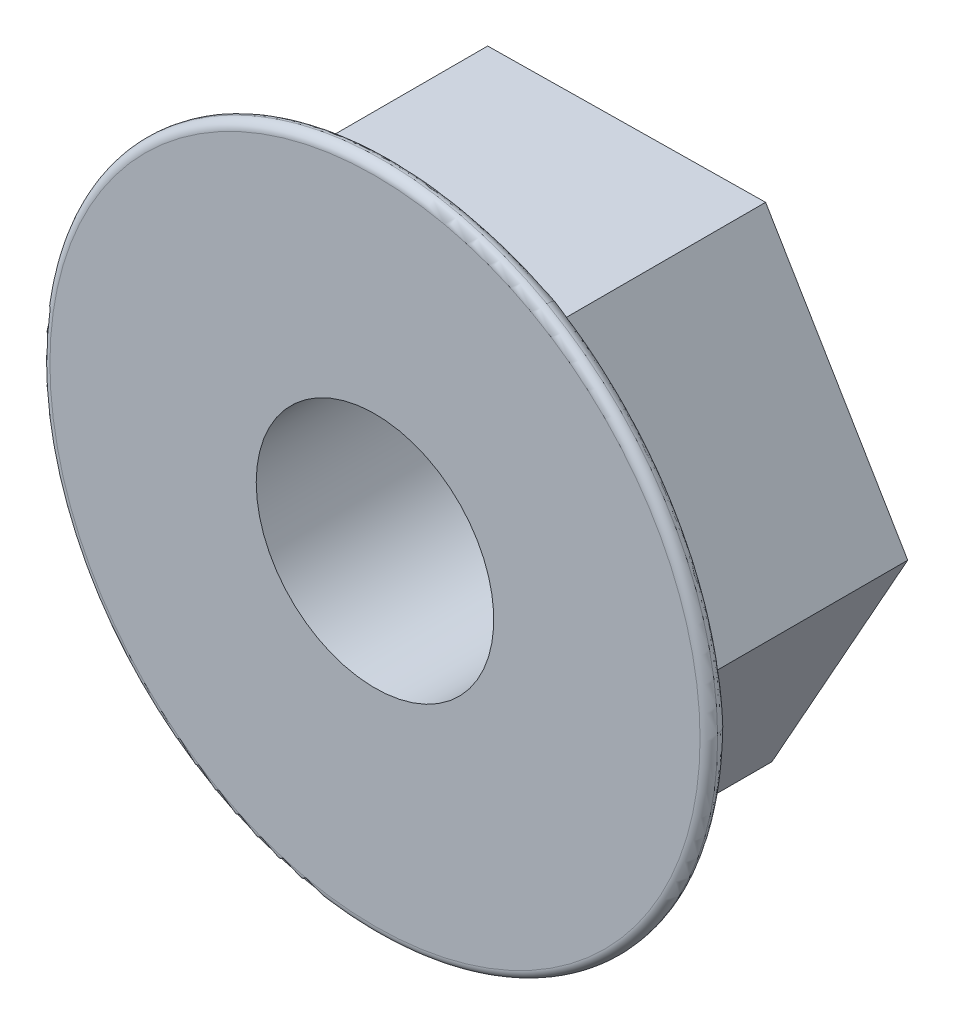
ISO-10303-21;
HEADER;
FILE_DESCRIPTION(('STEP AP214'),'2;1');
FILE_NAME('part.step','',(''),(''),'','','');
FILE_SCHEMA(('AUTOMOTIVE_DESIGN { 1 0 10303 214 1 1 1 1 }'));
ENDSEC;
DATA;
#1=APPLICATION_CONTEXT('core data for automotive mechanical design processes');
#2=APPLICATION_PROTOCOL_DEFINITION('international standard','automotive_design',2000,#1);
#3=PRODUCT_CONTEXT('',#1,'mechanical');
#4=PRODUCT('Part','Part','',(#3));
#5=PRODUCT_RELATED_PRODUCT_CATEGORY('part','',(#4));
#6=PRODUCT_DEFINITION_FORMATION('','',#4);
#7=PRODUCT_DEFINITION_CONTEXT('part definition',#1,'design');
#8=PRODUCT_DEFINITION('design','',#6,#7);
#9=PRODUCT_DEFINITION_SHAPE('','',#8);
#10=(LENGTH_UNIT() NAMED_UNIT(*) SI_UNIT(.MILLI.,.METRE.));
#11=(NAMED_UNIT(*) PLANE_ANGLE_UNIT() SI_UNIT($,.RADIAN.));
#12=(NAMED_UNIT(*) SI_UNIT($,.STERADIAN.) SOLID_ANGLE_UNIT());
#13=UNCERTAINTY_MEASURE_WITH_UNIT(LENGTH_MEASURE(1.E-05),#10,'distance_accuracy_value','');
#14=(GEOMETRIC_REPRESENTATION_CONTEXT(3) GLOBAL_UNCERTAINTY_ASSIGNED_CONTEXT((#13)) GLOBAL_UNIT_ASSIGNED_CONTEXT((#10,
#11,#12)) REPRESENTATION_CONTEXT('',''));
#15=CARTESIAN_POINT('',(0.,0.,0.));
#16=DIRECTION('',(0.,0.,1.));
#17=DIRECTION('',(1.,0.,0.));
#18=AXIS2_PLACEMENT_3D('',#15,#16,#17);
#19=CARTESIAN_POINT('',(0.,0.,0.));
#20=DIRECTION('',(0.,0.,1.));
#21=DIRECTION('',(1.,0.,0.));
#22=AXIS2_PLACEMENT_3D('',#19,#20,#21);
#23=PLANE('',#22);
#24=DIRECTION('',(0.999915696242774,0.0129846219555318,0.));
#25=VECTOR('',#24,1.);
#26=CARTESIAN_POINT('',(-1.93278563744729,-3.45038737144263,0.));
#27=LINE('',#26,#25);
#28=CARTESIAN_POINT('',(-1.93278563744729,-3.45038737144263,0.));
#29=VERTEX_POINT('',#28);
#30=CARTESIAN_POINT('',(2.02173029784268,-3.39903514782037,0.));
#31=VERTEX_POINT('',#30);
#32=EDGE_CURVE('E723',#29,#31,#27,.T.);
#33=ORIENTED_EDGE('',*,*,#32,.F.);
#34=DIRECTION('',(0.511202860593414,-0.859460083611281,0.));
#35=VECTOR('',#34,1.);
#36=CARTESIAN_POINT('',(-3.95451593528998,-0.0513522236222572,0.));
#37=LINE('',#36,#35);
#38=CARTESIAN_POINT('',(-3.95451593528998,-0.0513522236222572,0.));
#39=VERTEX_POINT('',#38);
#40=EDGE_CURVE('E240',#39,#29,#37,.T.);
#41=ORIENTED_EDGE('',*,*,#40,.F.);
#42=DIRECTION('',(-0.48871283564936,-0.872444705566812,0.));
#43=VECTOR('',#42,1.);
#44=CARTESIAN_POINT('',(-2.02173029784268,3.39903514782037,0.));
#45=LINE('',#44,#43);
#46=CARTESIAN_POINT('',(-2.02173029784268,3.39903514782037,0.));
#47=VERTEX_POINT('',#46);
#48=EDGE_CURVE('E712',#47,#39,#45,.T.);
#49=ORIENTED_EDGE('',*,*,#48,.F.);
#50=DIRECTION('',(-0.999915696242774,-0.0129846219555313,0.));
#51=VECTOR('',#50,1.);
#52=CARTESIAN_POINT('',(1.93278563744729,3.45038737144263,0.));
#53=LINE('',#52,#51);
#54=CARTESIAN_POINT('',(1.93278563744729,3.45038737144263,0.));
#55=VERTEX_POINT('',#54);
#56=EDGE_CURVE('E715',#55,#47,#53,.T.);
#57=ORIENTED_EDGE('',*,*,#56,.F.);
#58=DIRECTION('',(-0.511202860593415,0.859460083611281,0.));
#59=VECTOR('',#58,1.);
#60=CARTESIAN_POINT('',(3.95451593528998,0.0513522236222591,0.));
#61=LINE('',#60,#59);
#62=CARTESIAN_POINT('',(3.95451593528998,0.0513522236222591,0.));
#63=VERTEX_POINT('',#62);
#64=EDGE_CURVE('E718',#63,#55,#61,.T.);
#65=ORIENTED_EDGE('',*,*,#64,.F.);
#66=DIRECTION('',(0.48871283564936,0.872444705566812,0.));
#67=VECTOR('',#66,1.);
#68=CARTESIAN_POINT('',(2.02173029784268,-3.39903514782037,0.));
#69=LINE('',#68,#67);
#70=EDGE_CURVE('E721',#31,#63,#69,.T.);
#71=ORIENTED_EDGE('',*,*,#70,.F.);
#72=EDGE_LOOP('',(#33,#41,#49,#57,#65,#71));
#73=FACE_BOUND('',#72,.T.);
#74=CARTESIAN_POINT('',(0.,0.,0.));
#75=DIRECTION('',(0.,0.,1.));
#76=DIRECTION('',(1.,0.,0.));
#77=AXIS2_PLACEMENT_3D('',#74,#75,#76);
#78=CIRCLE('',#77,1.69);
#79=CARTESIAN_POINT('',(1.69,0.,0.));
#80=VERTEX_POINT('',#79);
#81=EDGE_CURVE('E344',#80,#80,#78,.T.);
#82=ORIENTED_EDGE('',*,*,#81,.T.);
#83=EDGE_LOOP('',(#82));
#84=FACE_BOUND('',#83,.T.);
#85=ADVANCED_FACE('F147',(#73,#84),#23,.F.);
#86=CARTESIAN_POINT('',(-1.93278563744729,-3.45038737144263,3.));
#87=DIRECTION('',(-0.0129846219555318,0.999915696242774,0.));
#88=DIRECTION('',(-0.999915696242774,-0.0129846219555318,0.));
#89=AXIS2_PLACEMENT_3D('',#86,#87,#88);
#90=PLANE('',#89);
#91=ORIENTED_EDGE('',*,*,#32,.T.);
#92=DIRECTION('',(0.,0.,-1.));
#93=VECTOR('',#92,1.);
#94=CARTESIAN_POINT('',(2.02173029784268,-3.39903514782037,3.));
#95=LINE('',#94,#93);
#96=CARTESIAN_POINT('',(2.02173029784268,-3.39903514782037,3.));
#97=VERTEX_POINT('',#96);
#98=EDGE_CURVE('E160',#97,#31,#95,.T.);
#99=ORIENTED_EDGE('',*,*,#98,.F.);
#100=DIRECTION('',(-0.999915696242774,-0.0129846219555318,0.));
#101=VECTOR('',#100,1.);
#102=CARTESIAN_POINT('',(-1.93278563744729,-3.45038737144263,3.));
#103=LINE('',#102,#101);
#104=CARTESIAN_POINT('',(-1.93278563744729,-3.45038737144263,3.));
#105=VERTEX_POINT('',#104);
#106=EDGE_CURVE('E227',#105,#97,#103,.F.);
#107=ORIENTED_EDGE('',*,*,#106,.F.);
#108=DIRECTION('',(0.,0.,-1.));
#109=VECTOR('',#108,1.);
#110=CARTESIAN_POINT('',(-1.93278563744729,-3.45038737144263,3.));
#111=LINE('',#110,#109);
#112=EDGE_CURVE('E231',#105,#29,#111,.T.);
#113=ORIENTED_EDGE('',*,*,#112,.T.);
#114=EDGE_LOOP('',(#91,#99,#107,#113));
#115=FACE_BOUND('',#114,.T.);
#116=ADVANCED_FACE('F230',(#115),#90,.F.);
#117=CARTESIAN_POINT('',(2.02173029784268,-3.39903514782037,3.));
#118=DIRECTION('',(-0.872444705566812,0.48871283564936,0.));
#119=DIRECTION('',(-0.48871283564936,-0.872444705566812,0.));
#120=AXIS2_PLACEMENT_3D('',#117,#118,#119);
#121=PLANE('',#120);
#122=ORIENTED_EDGE('',*,*,#70,.T.);
#123=DIRECTION('',(0.,0.,-1.));
#124=VECTOR('',#123,1.);
#125=CARTESIAN_POINT('',(3.95451593528998,0.0513522236222591,3.));
#126=LINE('',#125,#124);
#127=CARTESIAN_POINT('',(3.95451593528998,0.0513522236222596,3.));
#128=VERTEX_POINT('',#127);
#129=EDGE_CURVE('E696',#128,#63,#126,.T.);
#130=ORIENTED_EDGE('',*,*,#129,.F.);
#131=DIRECTION('',(-0.48871283564936,-0.872444705566812,0.));
#132=VECTOR('',#131,1.);
#133=CARTESIAN_POINT('',(2.02173029784268,-3.39903514782037,3.));
#134=LINE('',#133,#132);
#135=EDGE_CURVE('E239',#97,#128,#134,.F.);
#136=ORIENTED_EDGE('',*,*,#135,.F.);
#137=ORIENTED_EDGE('',*,*,#98,.T.);
#138=EDGE_LOOP('',(#122,#130,#136,#137));
#139=FACE_BOUND('',#138,.T.);
#140=ADVANCED_FACE('F470',(#139),#121,.F.);
#141=CARTESIAN_POINT('',(3.95451593528998,0.0513522236222591,3.));
#142=DIRECTION('',(-0.859460083611281,-0.511202860593415,0.));
#143=DIRECTION('',(0.511202860593415,-0.859460083611281,0.));
#144=AXIS2_PLACEMENT_3D('',#141,#142,#143);
#145=PLANE('',#144);
#146=ORIENTED_EDGE('',*,*,#64,.T.);
#147=DIRECTION('',(0.,0.,-1.));
#148=VECTOR('',#147,1.);
#149=CARTESIAN_POINT('',(1.93278563744729,3.45038737144263,3.));
#150=LINE('',#149,#148);
#151=CARTESIAN_POINT('',(1.93278563744729,3.45038737144263,3.));
#152=VERTEX_POINT('',#151);
#153=EDGE_CURVE('E700',#152,#55,#150,.T.);
#154=ORIENTED_EDGE('',*,*,#153,.F.);
#155=DIRECTION('',(0.511202860593415,-0.859460083611281,0.));
#156=VECTOR('',#155,1.);
#157=CARTESIAN_POINT('',(3.95451593528998,0.0513522236222591,3.));
#158=LINE('',#157,#156);
#159=EDGE_CURVE('E687',#128,#152,#158,.F.);
#160=ORIENTED_EDGE('',*,*,#159,.F.);
#161=ORIENTED_EDGE('',*,*,#129,.T.);
#162=EDGE_LOOP('',(#146,#154,#160,#161));
#163=FACE_BOUND('',#162,.T.);
#164=ADVANCED_FACE('F466',(#163),#145,.F.);
#165=CARTESIAN_POINT('',(1.93278563744729,3.45038737144263,3.));
#166=DIRECTION('',(0.0129846219555313,-0.999915696242774,0.));
#167=DIRECTION('',(0.999915696242774,0.0129846219555313,0.));
#168=AXIS2_PLACEMENT_3D('',#165,#166,#167);
#169=PLANE('',#168);
#170=ORIENTED_EDGE('',*,*,#56,.T.);
#171=DIRECTION('',(0.,0.,-1.));
#172=VECTOR('',#171,1.);
#173=CARTESIAN_POINT('',(-2.02173029784268,3.39903514782037,3.));
#174=LINE('',#173,#172);
#175=CARTESIAN_POINT('',(-2.02173029784268,3.39903514782037,3.));
#176=VERTEX_POINT('',#175);
#177=EDGE_CURVE('E704',#176,#47,#174,.T.);
#178=ORIENTED_EDGE('',*,*,#177,.F.);
#179=DIRECTION('',(0.999915696242774,0.0129846219555313,0.));
#180=VECTOR('',#179,1.);
#181=CARTESIAN_POINT('',(1.93278563744729,3.45038737144263,3.));
#182=LINE('',#181,#180);
#183=EDGE_CURVE('E268',#152,#176,#182,.F.);
#184=ORIENTED_EDGE('',*,*,#183,.F.);
#185=ORIENTED_EDGE('',*,*,#153,.T.);
#186=EDGE_LOOP('',(#170,#178,#184,#185));
#187=FACE_BOUND('',#186,.T.);
#188=ADVANCED_FACE('F463',(#187),#169,.F.);
#189=CARTESIAN_POINT('',(-2.02173029784268,3.39903514782037,3.));
#190=DIRECTION('',(0.872444705566812,-0.48871283564936,0.));
#191=DIRECTION('',(0.48871283564936,0.872444705566812,0.));
#192=AXIS2_PLACEMENT_3D('',#189,#190,#191);
#193=PLANE('',#192);
#194=ORIENTED_EDGE('',*,*,#48,.T.);
#195=DIRECTION('',(0.,0.,-1.));
#196=VECTOR('',#195,1.);
#197=CARTESIAN_POINT('',(-3.95451593528998,-0.0513522236222572,3.));
#198=LINE('',#197,#196);
#199=CARTESIAN_POINT('',(-3.95451593528998,-0.0513522236222578,3.));
#200=VERTEX_POINT('',#199);
#201=EDGE_CURVE('E168',#200,#39,#198,.T.);
#202=ORIENTED_EDGE('',*,*,#201,.F.);
#203=DIRECTION('',(0.48871283564936,0.872444705566812,0.));
#204=VECTOR('',#203,1.);
#205=CARTESIAN_POINT('',(-2.02173029784268,3.39903514782037,3.));
#206=LINE('',#205,#204);
#207=EDGE_CURVE('E265',#176,#200,#206,.F.);
#208=ORIENTED_EDGE('',*,*,#207,.F.);
#209=ORIENTED_EDGE('',*,*,#177,.T.);
#210=EDGE_LOOP('',(#194,#202,#208,#209));
#211=FACE_BOUND('',#210,.T.);
#212=ADVANCED_FACE('F460',(#211),#193,.F.);
#213=CARTESIAN_POINT('',(-3.95451593528998,-0.0513522236222572,3.));
#214=DIRECTION('',(0.859460083611281,0.511202860593414,0.));
#215=DIRECTION('',(-0.511202860593414,0.859460083611281,0.));
#216=AXIS2_PLACEMENT_3D('',#213,#214,#215);
#217=PLANE('',#216);
#218=ORIENTED_EDGE('',*,*,#40,.T.);
#219=ORIENTED_EDGE('',*,*,#112,.F.);
#220=DIRECTION('',(-0.511202860593414,0.859460083611281,0.));
#221=VECTOR('',#220,1.);
#222=CARTESIAN_POINT('',(-3.95451593528998,-0.0513522236222572,3.));
#223=LINE('',#222,#221);
#224=EDGE_CURVE('E245',#200,#105,#223,.F.);
#225=ORIENTED_EDGE('',*,*,#224,.F.);
#226=ORIENTED_EDGE('',*,*,#201,.T.);
#227=EDGE_LOOP('',(#218,#219,#225,#226));
#228=FACE_BOUND('',#227,.T.);
#229=ADVANCED_FACE('F243',(#228),#217,.F.);
#230=CARTESIAN_POINT('',(0.,0.,3.));
#231=DIRECTION('',(0.,0.,-1.));
#232=DIRECTION('',(-1.,0.,0.));
#233=AXIS2_PLACEMENT_3D('',#230,#231,#232);
#234=CYLINDRICAL_SURFACE('',#233,1.69);
#235=ORIENTED_EDGE('',*,*,#81,.F.);
#236=EDGE_LOOP('',(#235));
#237=FACE_BOUND('',#236,.T.);
#238=CARTESIAN_POINT('',(0.,0.,3.625));
#239=DIRECTION('',(0.,0.,-1.));
#240=DIRECTION('',(-1.,0.,0.));
#241=AXIS2_PLACEMENT_3D('',#238,#239,#240);
#242=CIRCLE('',#241,1.69);
#243=CARTESIAN_POINT('',(-1.69,0.,3.625));
#244=VERTEX_POINT('',#243);
#245=EDGE_CURVE('E371',#244,#244,#242,.T.);
#246=ORIENTED_EDGE('',*,*,#245,.F.);
#247=EDGE_LOOP('',(#246));
#248=FACE_BOUND('',#247,.T.);
#249=ADVANCED_FACE('F446',(#237,#248),#234,.F.);
#250=CARTESIAN_POINT('',(-3.95451593528998,-0.051352223622258,3.));
#251=CARTESIAN_POINT('',(-3.95451593528998,-0.051352223622258,3.18785787881464));
#252=CARTESIAN_POINT('',(-4.74959955715318,-0.0616769542887728,3.18690353530893));
#253=CARTESIAN_POINT('',(-4.74959955715318,-0.0616769542887728,3.5));
#254=CARTESIAN_POINT('',(-3.28060583600908,-1.18436393956238,3.));
#255=CARTESIAN_POINT('',(-3.28060583600908,-1.18436393956238,3.18785787881464));
#256=CARTESIAN_POINT('',(-4.72756772072772,-1.75829770569109,3.18690353530893));
#257=CARTESIAN_POINT('',(-4.72756772072772,-1.75829770569109,3.5));
#258=CARTESIAN_POINT('',(-2.60669573672819,-2.31737565550251,3.));
#259=CARTESIAN_POINT('',(-2.60669573672819,-2.31737565550251,3.18785787881464));
#260=CARTESIAN_POINT('',(-3.80171855884944,-3.31488210577767,3.18690353530893));
#261=CARTESIAN_POINT('',(-3.80171855884944,-3.31488210577767,3.5));
#262=CARTESIAN_POINT('',(-1.93278563744729,-3.45038737144263,3.));
#263=CARTESIAN_POINT('',(-1.93278563744729,-3.45038737144263,3.18785787881464));
#264=CARTESIAN_POINT('',(-2.32138596933446,-4.14411235144236,3.18690353530893));
#265=CARTESIAN_POINT('',(-2.32138596933446,-4.14411235144236,3.5));
#266=B_SPLINE_SURFACE_WITH_KNOTS('',3,3,((#250,#251,#252,#253),(#254,#255,#256,#257),(#258,#259,
#260,#261),(#262,#263,#264,#265)),.UNSPECIFIED.,.F.,.F.,.F.,(4,4),(4,4),(0.,1.),(0.,1.),.UNSPECIFIED.);
#267=CARTESIAN_POINT('',(-1.93278563744729,-3.45038737144263,3.));
#268=CARTESIAN_POINT('',(-1.93278563744729,-3.45038737144263,3.18785787881464));
#269=CARTESIAN_POINT('',(-2.32138596933446,-4.14411235144236,3.18690353530893));
#270=CARTESIAN_POINT('',(-2.32138596933446,-4.14411235144236,3.5));
#271=B_SPLINE_CURVE_WITH_KNOTS('',3,(#267,#268,#269,#270),.UNSPECIFIED.,.F.,.F.,(4,4),(0.,1.),.UNSPECIFIED.);
#272=CARTESIAN_POINT('',(-2.32154513859906,-4.144398177412,3.5));
#273=VERTEX_POINT('',#272);
#274=EDGE_CURVE('E252',#105,#273,#271,.T.);
#275=CARTESIAN_POINT('',(0.,0.,3.5));
#276=DIRECTION('',(0.,0.,1.));
#277=DIRECTION('',(1.,0.,0.));
#278=AXIS2_PLACEMENT_3D('',#275,#276,#277);
#279=CIRCLE('',#278,4.75);
#280=CARTESIAN_POINT('',(-4.74959955715318,-0.0616769542887728,3.5));
#281=VERTEX_POINT('',#280);
#282=EDGE_CURVE('E316',#281,#273,#279,.T.);
#283=CARTESIAN_POINT('',(-3.95451593528998,-0.051352223622258,3.));
#284=CARTESIAN_POINT('',(-3.95451593528998,-0.051352223622258,3.18785787881464));
#285=CARTESIAN_POINT('',(-4.74959955715318,-0.0616769542887728,3.18690353530893));
#286=CARTESIAN_POINT('',(-4.74959955715318,-0.0616769542887728,3.5));
#287=B_SPLINE_CURVE_WITH_KNOTS('',3,(#283,#284,#285,#286),.UNSPECIFIED.,.F.,.F.,(4,4),(0.,1.),.UNSPECIFIED.);
#288=EDGE_CURVE('E260',#281,#200,#287,.F.);
#289=ORIENTED_EDGE('',*,*,#224,.T.);
#290=ORIENTED_EDGE('',*,*,#274,.T.);
#291=ORIENTED_EDGE('',*,*,#282,.F.);
#292=ORIENTED_EDGE('',*,*,#288,.T.);
#293=EDGE_LOOP('',(#289,#290,#291,#292));
#294=FACE_BOUND('',#293,.T.);
#295=ADVANCED_FACE('F263',(#294),#266,.T.);
#296=CARTESIAN_POINT('',(-1.93278563744729,-3.45038737144263,3.));
#297=CARTESIAN_POINT('',(-1.93278563744729,-3.45038737144263,3.18785787881464));
#298=CARTESIAN_POINT('',(-2.32138596933446,-4.14411235144236,3.18690353530893));
#299=CARTESIAN_POINT('',(-2.32138596933446,-4.14411235144236,3.5));
#300=CARTESIAN_POINT('',(-0.614613659017302,-3.43326996356854,3.));
#301=CARTESIAN_POINT('',(-0.614613659017302,-3.43326996356854,3.18785787881464));
#302=CARTESIAN_POINT('',(-0.841053379819481,-4.97334259710705,3.18690353530893));
#303=CARTESIAN_POINT('',(-0.841053379819481,-4.97334259710705,3.5));
#304=CARTESIAN_POINT('',(0.703558319412691,-3.41615255569446,3.));
#305=CARTESIAN_POINT('',(0.703558319412691,-3.41615255569446,3.18785787881464));
#306=CARTESIAN_POINT('',(0.969912834729197,-4.94982590289121,3.18690353530893));
#307=CARTESIAN_POINT('',(0.969912834729196,-4.94982590289121,3.5));
#308=CARTESIAN_POINT('',(2.02173029784268,-3.39903514782037,3.));
#309=CARTESIAN_POINT('',(2.02173029784268,-3.39903514782037,3.18785787881464));
#310=CARTESIAN_POINT('',(2.42821358781872,-4.08243539715359,3.18690353530893));
#311=CARTESIAN_POINT('',(2.42821358781872,-4.08243539715359,3.5));
#312=B_SPLINE_SURFACE_WITH_KNOTS('',3,3,((#296,#297,#298,#299),(#300,#301,#302,#303),(#304,#305,
#306,#307),(#308,#309,#310,#311)),.UNSPECIFIED.,.F.,.F.,.F.,(4,4),(4,4),(0.,1.),(0.,1.),.UNSPECIFIED.);
#313=CARTESIAN_POINT('',(2.02173029784268,-3.39903514782037,3.));
#314=CARTESIAN_POINT('',(2.02173029784268,-3.39903514782037,3.18785787881464));
#315=CARTESIAN_POINT('',(2.42821358781872,-4.08243539715359,3.18690353530893));
#316=CARTESIAN_POINT('',(2.42821358781872,-4.08243539715359,3.5));
#317=B_SPLINE_CURVE_WITH_KNOTS('',3,(#313,#314,#315,#316),.UNSPECIFIED.,.F.,.F.,(4,4),(0.,1.),.UNSPECIFIED.);
#318=CARTESIAN_POINT('',(2.42840474916067,-4.08275829189127,3.5));
#319=VERTEX_POINT('',#318);
#320=EDGE_CURVE('E259',#97,#319,#317,.T.);
#321=EDGE_CURVE('E255',#273,#319,#279,.T.);
#322=ORIENTED_EDGE('',*,*,#106,.T.);
#323=ORIENTED_EDGE('',*,*,#320,.T.);
#324=ORIENTED_EDGE('',*,*,#321,.F.);
#325=ORIENTED_EDGE('',*,*,#274,.F.);
#326=EDGE_LOOP('',(#322,#323,#324,#325));
#327=FACE_BOUND('',#326,.T.);
#328=ADVANCED_FACE('F253',(#327),#312,.T.);
#329=CARTESIAN_POINT('',(-2.02173029784268,3.39903514782037,3.));
#330=CARTESIAN_POINT('',(-2.02173029784268,3.39903514782037,3.18785787881464));
#331=CARTESIAN_POINT('',(-2.42821358781872,4.08243539715358,3.18690353530893));
#332=CARTESIAN_POINT('',(-2.42821358781872,4.08243539715358,3.5));
#333=CARTESIAN_POINT('',(-2.66599217699178,2.24890602400616,3.));
#334=CARTESIAN_POINT('',(-2.66599217699178,2.24890602400616,3.18785787881464));
#335=CARTESIAN_POINT('',(-3.88651434090824,3.21504489141596,3.18690353530893));
#336=CARTESIAN_POINT('',(-3.88651434090824,3.21504489141596,3.5));
#337=CARTESIAN_POINT('',(-3.31025405614088,1.09877690019195,3.));
#338=CARTESIAN_POINT('',(-3.31025405614088,1.09877690019195,3.18785787881464));
#339=CARTESIAN_POINT('',(-4.77163139357863,1.63494379711354,3.18690353530893));
#340=CARTESIAN_POINT('',(-4.77163139357863,1.63494379711354,3.5));
#341=CARTESIAN_POINT('',(-3.95451593528998,-0.0513522236222572,3.));
#342=CARTESIAN_POINT('',(-3.95451593528998,-0.0513522236222572,3.18785787881464));
#343=CARTESIAN_POINT('',(-4.74959955715318,-0.0616769542887729,3.18690353530893));
#344=CARTESIAN_POINT('',(-4.74959955715318,-0.0616769542887729,3.5));
#345=B_SPLINE_SURFACE_WITH_KNOTS('',3,3,((#329,#330,#331,#332),(#333,#334,#335,#336),(#337,#338,
#339,#340),(#341,#342,#343,#344)),.UNSPECIFIED.,.F.,.F.,.F.,(4,4),(4,4),(0.,1.),(0.,1.),.UNSPECIFIED.);
#346=CARTESIAN_POINT('',(-2.42840474906029,4.08275829172171,3.5));
#347=VERTEX_POINT('',#346);
#348=EDGE_CURVE('E152',#347,#281,#279,.T.);
#349=CARTESIAN_POINT('',(-2.02173029784268,3.39903514782037,3.));
#350=CARTESIAN_POINT('',(-2.02173029784268,3.39903514782037,3.18785787881464));
#351=CARTESIAN_POINT('',(-2.42821358781872,4.08243539715358,3.18690353530893));
#352=CARTESIAN_POINT('',(-2.42821358781872,4.08243539715358,3.5));
#353=B_SPLINE_CURVE_WITH_KNOTS('',3,(#349,#350,#351,#352),.UNSPECIFIED.,.F.,.F.,(4,4),(0.,1.),.UNSPECIFIED.);
#354=EDGE_CURVE('E336',#176,#347,#353,.T.);
#355=ORIENTED_EDGE('',*,*,#207,.T.);
#356=ORIENTED_EDGE('',*,*,#288,.F.);
#357=ORIENTED_EDGE('',*,*,#348,.F.);
#358=ORIENTED_EDGE('',*,*,#354,.F.);
#359=EDGE_LOOP('',(#355,#356,#357,#358));
#360=FACE_BOUND('',#359,.T.);
#361=ADVANCED_FACE('F517',(#360),#345,.T.);
#362=CARTESIAN_POINT('',(2.02173029784268,-3.39903514782037,3.));
#363=CARTESIAN_POINT('',(2.02173029784268,-3.39903514782037,3.18785787881464));
#364=CARTESIAN_POINT('',(2.42821358781872,-4.08243539715359,3.18690353530893));
#365=CARTESIAN_POINT('',(2.42821358781872,-4.08243539715359,3.5));
#366=CARTESIAN_POINT('',(2.66599217699178,-2.24890602400616,3.));
#367=CARTESIAN_POINT('',(2.66599217699178,-2.24890602400616,3.18785787881464));
#368=CARTESIAN_POINT('',(3.88651434090824,-3.21504489141596,3.18690353530893));
#369=CARTESIAN_POINT('',(3.88651434090824,-3.21504489141596,3.5));
#370=CARTESIAN_POINT('',(3.31025405614088,-1.09877690019195,3.));
#371=CARTESIAN_POINT('',(3.31025405614088,-1.09877690019195,3.18785787881464));
#372=CARTESIAN_POINT('',(4.77163139357863,-1.63494379711354,3.18690353530893));
#373=CARTESIAN_POINT('',(4.77163139357863,-1.63494379711354,3.5));
#374=CARTESIAN_POINT('',(3.95451593528998,0.0513522236222591,3.));
#375=CARTESIAN_POINT('',(3.95451593528998,0.0513522236222591,3.18785787881464));
#376=CARTESIAN_POINT('',(4.74959955715318,0.0616769542887744,3.18690353530893));
#377=CARTESIAN_POINT('',(4.74959955715318,0.0616769542887744,3.5));
#378=B_SPLINE_SURFACE_WITH_KNOTS('',3,3,((#362,#363,#364,#365),(#366,#367,#368,#369),(#370,#371,
#372,#373),(#374,#375,#376,#377)),.UNSPECIFIED.,.F.,.F.,.F.,(4,4),(4,4),(0.,1.),(0.,1.),.UNSPECIFIED.);
#379=CARTESIAN_POINT('',(3.95451593528998,0.0513522236222591,3.));
#380=CARTESIAN_POINT('',(3.95451593528998,0.0513522236222591,3.18785787881464));
#381=CARTESIAN_POINT('',(4.74959955715318,0.0616769542887744,3.18690353530893));
#382=CARTESIAN_POINT('',(4.74959955715318,0.0616769542887744,3.5));
#383=B_SPLINE_CURVE_WITH_KNOTS('',3,(#379,#380,#381,#382),.UNSPECIFIED.,.F.,.F.,(4,4),(0.,1.),.UNSPECIFIED.);
#384=CARTESIAN_POINT('',(4.74959955715318,0.0616769542887744,3.5));
#385=VERTEX_POINT('',#384);
#386=EDGE_CURVE('E363',#128,#385,#383,.T.);
#387=EDGE_CURVE('E276',#319,#385,#279,.T.);
#388=ORIENTED_EDGE('',*,*,#135,.T.);
#389=ORIENTED_EDGE('',*,*,#386,.T.);
#390=ORIENTED_EDGE('',*,*,#387,.F.);
#391=ORIENTED_EDGE('',*,*,#320,.F.);
#392=EDGE_LOOP('',(#388,#389,#390,#391));
#393=FACE_BOUND('',#392,.T.);
#394=ADVANCED_FACE('F523',(#393),#378,.T.);
#395=CARTESIAN_POINT('',(3.95451593528998,0.0513522236222598,3.));
#396=CARTESIAN_POINT('',(3.95451593528998,0.0513522236222598,3.18785787881464));
#397=CARTESIAN_POINT('',(4.74959955715318,0.0616769542887744,3.18690353530893));
#398=CARTESIAN_POINT('',(4.74959955715318,0.0616769542887744,3.5));
#399=CARTESIAN_POINT('',(3.28060583600908,1.18436393956238,3.));
#400=CARTESIAN_POINT('',(3.28060583600908,1.18436393956238,3.18785787881464));
#401=CARTESIAN_POINT('',(4.72756772072772,1.75829770569109,3.18690353530893));
#402=CARTESIAN_POINT('',(4.72756772072772,1.75829770569109,3.5));
#403=CARTESIAN_POINT('',(2.60669573672819,2.31737565550251,3.));
#404=CARTESIAN_POINT('',(2.60669573672819,2.31737565550251,3.18785787881464));
#405=CARTESIAN_POINT('',(3.80171855884944,3.31488210577767,3.18690353530893));
#406=CARTESIAN_POINT('',(3.80171855884944,3.31488210577767,3.5));
#407=CARTESIAN_POINT('',(1.93278563744729,3.45038737144263,3.));
#408=CARTESIAN_POINT('',(1.93278563744729,3.45038737144263,3.18785787881464));
#409=CARTESIAN_POINT('',(2.32138596933446,4.14411235144236,3.18690353530893));
#410=CARTESIAN_POINT('',(2.32138596933446,4.14411235144236,3.5));
#411=B_SPLINE_SURFACE_WITH_KNOTS('',3,3,((#395,#396,#397,#398),(#399,#400,#401,#402),(#403,#404,
#405,#406),(#407,#408,#409,#410)),.UNSPECIFIED.,.F.,.F.,.F.,(4,4),(4,4),(0.,1.),(0.,1.),.UNSPECIFIED.);
#412=CARTESIAN_POINT('',(1.93278563744729,3.45038737144263,3.));
#413=CARTESIAN_POINT('',(1.93278563744729,3.45038737144263,3.18785787881464));
#414=CARTESIAN_POINT('',(2.32138596933446,4.14411235144236,3.18690353530893));
#415=CARTESIAN_POINT('',(2.32138596933446,4.14411235144236,3.5));
#416=B_SPLINE_CURVE_WITH_KNOTS('',3,(#412,#413,#414,#415),.UNSPECIFIED.,.F.,.F.,(4,4),(0.,1.),.UNSPECIFIED.);
#417=CARTESIAN_POINT('',(2.32154513859912,4.14439817741211,3.5));
#418=VERTEX_POINT('',#417);
#419=EDGE_CURVE('E359',#152,#418,#416,.T.);
#420=EDGE_CURVE('E287',#385,#418,#279,.T.);
#421=ORIENTED_EDGE('',*,*,#159,.T.);
#422=ORIENTED_EDGE('',*,*,#419,.T.);
#423=ORIENTED_EDGE('',*,*,#420,.F.);
#424=ORIENTED_EDGE('',*,*,#386,.F.);
#425=EDGE_LOOP('',(#421,#422,#423,#424));
#426=FACE_BOUND('',#425,.T.);
#427=ADVANCED_FACE('F441',(#426),#411,.T.);
#428=CARTESIAN_POINT('',(1.9327856374473,3.45038737144263,3.));
#429=CARTESIAN_POINT('',(1.9327856374473,3.45038737144263,3.18785787881464));
#430=CARTESIAN_POINT('',(2.32138596933446,4.14411235144236,3.18690353530893));
#431=CARTESIAN_POINT('',(2.32138596933446,4.14411235144236,3.5));
#432=CARTESIAN_POINT('',(0.614613659017302,3.43326996356854,3.));
#433=CARTESIAN_POINT('',(0.614613659017302,3.43326996356854,3.18785787881464));
#434=CARTESIAN_POINT('',(0.84105337981948,4.97334259710705,3.18690353530893));
#435=CARTESIAN_POINT('',(0.84105337981948,4.97334259710705,3.5));
#436=CARTESIAN_POINT('',(-0.703558319412691,3.41615255569446,3.));
#437=CARTESIAN_POINT('',(-0.703558319412691,3.41615255569446,3.18785787881464));
#438=CARTESIAN_POINT('',(-0.969912834729198,4.94982590289121,3.18690353530893));
#439=CARTESIAN_POINT('',(-0.969912834729198,4.94982590289121,3.5));
#440=CARTESIAN_POINT('',(-2.02173029784268,3.39903514782037,3.));
#441=CARTESIAN_POINT('',(-2.02173029784268,3.39903514782037,3.18785787881464));
#442=CARTESIAN_POINT('',(-2.42821358781872,4.08243539715358,3.18690353530893));
#443=CARTESIAN_POINT('',(-2.42821358781872,4.08243539715358,3.5));
#444=B_SPLINE_SURFACE_WITH_KNOTS('',3,3,((#428,#429,#430,#431),(#432,#433,#434,#435),(#436,#437,
#438,#439),(#440,#441,#442,#443)),.UNSPECIFIED.,.F.,.F.,.F.,(4,4),(4,4),(0.,1.),(0.,1.),.UNSPECIFIED.);
#445=EDGE_CURVE('E297',#418,#347,#279,.T.);
#446=ORIENTED_EDGE('',*,*,#183,.T.);
#447=ORIENTED_EDGE('',*,*,#354,.T.);
#448=ORIENTED_EDGE('',*,*,#445,.F.);
#449=ORIENTED_EDGE('',*,*,#419,.F.);
#450=EDGE_LOOP('',(#446,#447,#448,#449));
#451=FACE_BOUND('',#450,.T.);
#452=ADVANCED_FACE('F428',(#451),#444,.T.);
#453=CARTESIAN_POINT('',(0.,0.,3.625));
#454=DIRECTION('',(0.,0.,1.));
#455=DIRECTION('',(1.,0.,0.));
#456=AXIS2_PLACEMENT_3D('',#453,#454,#455);
#457=PLANE('',#456);
#458=ORIENTED_EDGE('',*,*,#245,.T.);
#459=EDGE_LOOP('',(#458));
#460=FACE_BOUND('',#459,.T.);
#461=CARTESIAN_POINT('',(0.,0.,3.625));
#462=DIRECTION('',(0.,0.,1.));
#463=DIRECTION('',(1.,0.,0.));
#464=AXIS2_PLACEMENT_3D('',#461,#462,#463);
#465=CIRCLE('',#464,4.625);
#466=CARTESIAN_POINT('',(4.625,0.,3.625));
#467=VERTEX_POINT('',#466);
#468=EDGE_CURVE('E12',#467,#467,#465,.T.);
#469=ORIENTED_EDGE('',*,*,#468,.T.);
#470=EDGE_LOOP('',(#469));
#471=FACE_BOUND('',#470,.T.);
#472=ADVANCED_FACE('F440',(#460,#471),#457,.T.);
#473=CARTESIAN_POINT('',(0.,0.,3.5));
#474=DIRECTION('',(0.,0.,1.));
#475=DIRECTION('',(1.,0.,0.));
#476=AXIS2_PLACEMENT_3D('',#473,#474,#475);
#477=TOROIDAL_SURFACE('',#476,4.625,0.125);
#478=ORIENTED_EDGE('',*,*,#282,.T.);
#479=ORIENTED_EDGE('',*,*,#321,.T.);
#480=ORIENTED_EDGE('',*,*,#387,.T.);
#481=ORIENTED_EDGE('',*,*,#420,.T.);
#482=ORIENTED_EDGE('',*,*,#445,.T.);
#483=ORIENTED_EDGE('',*,*,#348,.T.);
#484=EDGE_LOOP('',(#478,#479,#480,#481,#482,#483));
#485=FACE_BOUND('',#484,.T.);
#486=ORIENTED_EDGE('',*,*,#468,.F.);
#487=EDGE_LOOP('',(#486));
#488=FACE_BOUND('',#487,.T.);
#489=ADVANCED_FACE('F149',(#485,#488),#477,.T.);
#490=CLOSED_SHELL('',(#85,#116,#140,#164,#188,#212,#229,#249,#295,#328,#361,#394,#427,#452,#472,#489));
#491=MANIFOLD_SOLID_BREP('B2',#490);
#492=ADVANCED_BREP_SHAPE_REPRESENTATION('',(#18,#491),#14);
#493=SHAPE_DEFINITION_REPRESENTATION(#9,#492);
ENDSEC;
END-ISO-10303-21;
